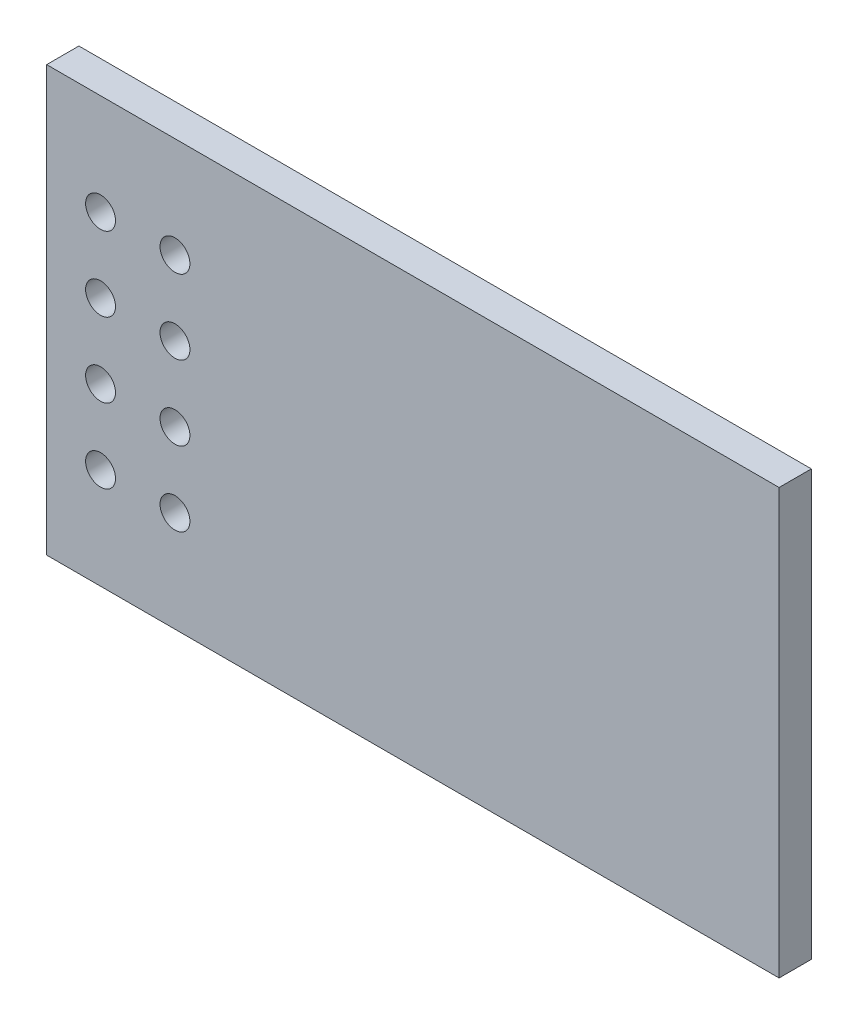
ISO-10303-21;
HEADER;
FILE_DESCRIPTION(('STEP AP214'),'2;1');
FILE_NAME('part.step','',(''),(''),'','','');
FILE_SCHEMA(('AUTOMOTIVE_DESIGN { 1 0 10303 214 1 1 1 1 }'));
ENDSEC;
DATA;
#1=APPLICATION_CONTEXT('core data for automotive mechanical design processes');
#2=APPLICATION_PROTOCOL_DEFINITION('international standard','automotive_design',2000,#1);
#3=PRODUCT_CONTEXT('',#1,'mechanical');
#4=PRODUCT('Part','Part','',(#3));
#5=PRODUCT_RELATED_PRODUCT_CATEGORY('part','',(#4));
#6=PRODUCT_DEFINITION_FORMATION('','',#4);
#7=PRODUCT_DEFINITION_CONTEXT('part definition',#1,'design');
#8=PRODUCT_DEFINITION('design','',#6,#7);
#9=PRODUCT_DEFINITION_SHAPE('','',#8);
#10=(LENGTH_UNIT() NAMED_UNIT(*) SI_UNIT(.MILLI.,.METRE.));
#11=(NAMED_UNIT(*) PLANE_ANGLE_UNIT() SI_UNIT($,.RADIAN.));
#12=(NAMED_UNIT(*) SI_UNIT($,.STERADIAN.) SOLID_ANGLE_UNIT());
#13=UNCERTAINTY_MEASURE_WITH_UNIT(LENGTH_MEASURE(1.E-05),#10,'distance_accuracy_value','');
#14=(GEOMETRIC_REPRESENTATION_CONTEXT(3) GLOBAL_UNCERTAINTY_ASSIGNED_CONTEXT((#13)) GLOBAL_UNIT_ASSIGNED_CONTEXT((#10,
#11,#12)) REPRESENTATION_CONTEXT('',''));
#15=CARTESIAN_POINT('',(0.,0.,0.));
#16=DIRECTION('',(0.,0.,1.));
#17=DIRECTION('',(1.,0.,0.));
#18=AXIS2_PLACEMENT_3D('',#15,#16,#17);
#19=CARTESIAN_POINT('',(4.37910274506,11.06,0.1));
#20=DIRECTION('',(0.,0.,1.));
#21=DIRECTION('',(0.877582561890372,0.479425538604204,0.));
#22=AXIS2_PLACEMENT_3D('',#19,#20,#21);
#23=CYLINDRICAL_SURFACE('',#22,0.51);
#24=CARTESIAN_POINT('',(4.37910274506,11.06,0.));
#25=DIRECTION('',(0.,0.,1.));
#26=DIRECTION('',(-1.,0.,0.));
#27=AXIS2_PLACEMENT_3D('',#24,#25,#26);
#28=CIRCLE('',#27,0.51);
#29=CARTESIAN_POINT('',(3.93153563849591,10.8154929753119,0.));
#30=VERTEX_POINT('',#29);
#31=EDGE_CURVE('E192',#30,#30,#28,.T.);
#32=ORIENTED_EDGE('',*,*,#31,.F.);
#33=DIRECTION('',(0.,0.,1.));
#34=VECTOR('',#33,1.);
#35=CARTESIAN_POINT('',(3.93153563849591,10.8154929753119,0.1));
#36=LINE('',#35,#34);
#37=CARTESIAN_POINT('',(3.93153563849591,10.8154929753119,1.1));
#38=VERTEX_POINT('',#37);
#39=EDGE_CURVE('E11',#30,#38,#36,.T.);
#40=ORIENTED_EDGE('',*,*,#39,.T.);
#41=CARTESIAN_POINT('',(4.37910274506,11.06,1.1));
#42=DIRECTION('',(0.,0.,1.));
#43=DIRECTION('',(-1.,0.,0.));
#44=AXIS2_PLACEMENT_3D('',#41,#42,#43);
#45=CIRCLE('',#44,0.51);
#46=EDGE_CURVE('E132',#38,#38,#45,.T.);
#47=ORIENTED_EDGE('',*,*,#46,.T.);
#48=ORIENTED_EDGE('',*,*,#39,.F.);
#49=EDGE_LOOP('',(#32,#40,#47,#48));
#50=FACE_BOUND('',#49,.T.);
#51=ADVANCED_FACE('F16',(#50),#23,.F.);
#52=CARTESIAN_POINT('',(1.83910274506,11.06,0.1));
#53=DIRECTION('',(0.,0.,1.));
#54=DIRECTION('',(0.877582561890372,0.479425538604204,0.));
#55=AXIS2_PLACEMENT_3D('',#52,#53,#54);
#56=CYLINDRICAL_SURFACE('',#55,0.51);
#57=CARTESIAN_POINT('',(1.83910274506,11.06,0.));
#58=DIRECTION('',(0.,0.,1.));
#59=DIRECTION('',(-1.,0.,0.));
#60=AXIS2_PLACEMENT_3D('',#57,#58,#59);
#61=CIRCLE('',#60,0.51);
#62=CARTESIAN_POINT('',(1.39153563849591,10.8154929753119,0.));
#63=VERTEX_POINT('',#62);
#64=EDGE_CURVE('E224',#63,#63,#61,.T.);
#65=ORIENTED_EDGE('',*,*,#64,.F.);
#66=DIRECTION('',(0.,0.,1.));
#67=VECTOR('',#66,1.);
#68=CARTESIAN_POINT('',(1.39153563849591,10.8154929753119,0.1));
#69=LINE('',#68,#67);
#70=CARTESIAN_POINT('',(1.39153563849591,10.8154929753119,1.1));
#71=VERTEX_POINT('',#70);
#72=EDGE_CURVE('E27',#63,#71,#69,.T.);
#73=ORIENTED_EDGE('',*,*,#72,.T.);
#74=CARTESIAN_POINT('',(1.83910274506,11.06,1.1));
#75=DIRECTION('',(0.,0.,1.));
#76=DIRECTION('',(-1.,0.,0.));
#77=AXIS2_PLACEMENT_3D('',#74,#75,#76);
#78=CIRCLE('',#77,0.51);
#79=EDGE_CURVE('E181',#71,#71,#78,.T.);
#80=ORIENTED_EDGE('',*,*,#79,.T.);
#81=ORIENTED_EDGE('',*,*,#72,.F.);
#82=EDGE_LOOP('',(#65,#73,#80,#81));
#83=FACE_BOUND('',#82,.T.);
#84=ADVANCED_FACE('F358',(#83),#56,.F.);
#85=CARTESIAN_POINT('',(4.37910274506,8.52,0.1));
#86=DIRECTION('',(0.,0.,1.));
#87=DIRECTION('',(0.877582561890372,0.479425538604204,0.));
#88=AXIS2_PLACEMENT_3D('',#85,#86,#87);
#89=CYLINDRICAL_SURFACE('',#88,0.51);
#90=CARTESIAN_POINT('',(4.37910274506,8.52,0.));
#91=DIRECTION('',(0.,0.,1.));
#92=DIRECTION('',(-1.,0.,0.));
#93=AXIS2_PLACEMENT_3D('',#90,#91,#92);
#94=CIRCLE('',#93,0.51);
#95=CARTESIAN_POINT('',(3.93153563849591,8.27549297531186,0.));
#96=VERTEX_POINT('',#95);
#97=EDGE_CURVE('E223',#96,#96,#94,.T.);
#98=ORIENTED_EDGE('',*,*,#97,.F.);
#99=DIRECTION('',(0.,0.,1.));
#100=VECTOR('',#99,1.);
#101=CARTESIAN_POINT('',(3.93153563849591,8.27549297531186,0.1));
#102=LINE('',#101,#100);
#103=CARTESIAN_POINT('',(3.93153563849591,8.27549297531186,1.1));
#104=VERTEX_POINT('',#103);
#105=EDGE_CURVE('E75',#96,#104,#102,.T.);
#106=ORIENTED_EDGE('',*,*,#105,.T.);
#107=CARTESIAN_POINT('',(4.37910274506,8.52,1.1));
#108=DIRECTION('',(0.,0.,1.));
#109=DIRECTION('',(-1.,0.,0.));
#110=AXIS2_PLACEMENT_3D('',#107,#108,#109);
#111=CIRCLE('',#110,0.51);
#112=EDGE_CURVE('E184',#104,#104,#111,.T.);
#113=ORIENTED_EDGE('',*,*,#112,.T.);
#114=ORIENTED_EDGE('',*,*,#105,.F.);
#115=EDGE_LOOP('',(#98,#106,#113,#114));
#116=FACE_BOUND('',#115,.T.);
#117=ADVANCED_FACE('F251',(#116),#89,.F.);
#118=CARTESIAN_POINT('',(1.83910274506,8.52,0.1));
#119=DIRECTION('',(0.,0.,1.));
#120=DIRECTION('',(0.877582561890372,0.479425538604204,0.));
#121=AXIS2_PLACEMENT_3D('',#118,#119,#120);
#122=CYLINDRICAL_SURFACE('',#121,0.51);
#123=CARTESIAN_POINT('',(1.83910274506,8.52,0.));
#124=DIRECTION('',(0.,0.,1.));
#125=DIRECTION('',(-1.,0.,0.));
#126=AXIS2_PLACEMENT_3D('',#123,#124,#125);
#127=CIRCLE('',#126,0.51);
#128=CARTESIAN_POINT('',(1.39153563849591,8.27549297531186,0.));
#129=VERTEX_POINT('',#128);
#130=EDGE_CURVE('E189',#129,#129,#127,.T.);
#131=ORIENTED_EDGE('',*,*,#130,.F.);
#132=DIRECTION('',(0.,0.,1.));
#133=VECTOR('',#132,1.);
#134=CARTESIAN_POINT('',(1.39153563849591,8.27549297531186,0.1));
#135=LINE('',#134,#133);
#136=CARTESIAN_POINT('',(1.39153563849591,8.27549297531186,1.1));
#137=VERTEX_POINT('',#136);
#138=EDGE_CURVE('E87',#129,#137,#135,.T.);
#139=ORIENTED_EDGE('',*,*,#138,.T.);
#140=CARTESIAN_POINT('',(1.83910274506,8.52,1.1));
#141=DIRECTION('',(0.,0.,1.));
#142=DIRECTION('',(-1.,0.,0.));
#143=AXIS2_PLACEMENT_3D('',#140,#141,#142);
#144=CIRCLE('',#143,0.51);
#145=EDGE_CURVE('E214',#137,#137,#144,.T.);
#146=ORIENTED_EDGE('',*,*,#145,.T.);
#147=ORIENTED_EDGE('',*,*,#138,.F.);
#148=EDGE_LOOP('',(#131,#139,#146,#147));
#149=FACE_BOUND('',#148,.T.);
#150=ADVANCED_FACE('F368',(#149),#122,.F.);
#151=CARTESIAN_POINT('',(4.37910274506,5.98,0.1));
#152=DIRECTION('',(0.,0.,1.));
#153=DIRECTION('',(0.877582561890372,0.479425538604204,0.));
#154=AXIS2_PLACEMENT_3D('',#151,#152,#153);
#155=CYLINDRICAL_SURFACE('',#154,0.51);
#156=CARTESIAN_POINT('',(4.37910274506,5.98,0.));
#157=DIRECTION('',(0.,0.,1.));
#158=DIRECTION('',(-1.,0.,0.));
#159=AXIS2_PLACEMENT_3D('',#156,#157,#158);
#160=CIRCLE('',#159,0.51);
#161=CARTESIAN_POINT('',(3.93153563849591,5.73549297531186,0.));
#162=VERTEX_POINT('',#161);
#163=EDGE_CURVE('E145',#162,#162,#160,.T.);
#164=ORIENTED_EDGE('',*,*,#163,.F.);
#165=DIRECTION('',(0.,0.,1.));
#166=VECTOR('',#165,1.);
#167=CARTESIAN_POINT('',(3.93153563849591,5.73549297531186,0.1));
#168=LINE('',#167,#166);
#169=CARTESIAN_POINT('',(3.93153563849591,5.73549297531186,1.1));
#170=VERTEX_POINT('',#169);
#171=EDGE_CURVE('E193',#162,#170,#168,.T.);
#172=ORIENTED_EDGE('',*,*,#171,.T.);
#173=CARTESIAN_POINT('',(4.37910274506,5.98,1.1));
#174=DIRECTION('',(0.,0.,1.));
#175=DIRECTION('',(-1.,0.,0.));
#176=AXIS2_PLACEMENT_3D('',#173,#174,#175);
#177=CIRCLE('',#176,0.51);
#178=EDGE_CURVE('E180',#170,#170,#177,.T.);
#179=ORIENTED_EDGE('',*,*,#178,.T.);
#180=ORIENTED_EDGE('',*,*,#171,.F.);
#181=EDGE_LOOP('',(#164,#172,#179,#180));
#182=FACE_BOUND('',#181,.T.);
#183=ADVANCED_FACE('F370',(#182),#155,.F.);
#184=CARTESIAN_POINT('',(1.83910274506,5.98,0.1));
#185=DIRECTION('',(0.,0.,1.));
#186=DIRECTION('',(0.877582561890372,0.479425538604204,0.));
#187=AXIS2_PLACEMENT_3D('',#184,#185,#186);
#188=CYLINDRICAL_SURFACE('',#187,0.51);
#189=CARTESIAN_POINT('',(1.83910274506,5.98,0.));
#190=DIRECTION('',(0.,0.,1.));
#191=DIRECTION('',(-1.,0.,0.));
#192=AXIS2_PLACEMENT_3D('',#189,#190,#191);
#193=CIRCLE('',#192,0.51);
#194=CARTESIAN_POINT('',(1.39153563849591,5.73549297531186,0.));
#195=VERTEX_POINT('',#194);
#196=EDGE_CURVE('E138',#195,#195,#193,.T.);
#197=ORIENTED_EDGE('',*,*,#196,.F.);
#198=DIRECTION('',(0.,0.,1.));
#199=VECTOR('',#198,1.);
#200=CARTESIAN_POINT('',(1.39153563849591,5.73549297531186,0.1));
#201=LINE('',#200,#199);
#202=CARTESIAN_POINT('',(1.39153563849591,5.73549297531186,1.1));
#203=VERTEX_POINT('',#202);
#204=EDGE_CURVE('E20',#195,#203,#201,.T.);
#205=ORIENTED_EDGE('',*,*,#204,.T.);
#206=CARTESIAN_POINT('',(1.83910274506,5.98,1.1));
#207=DIRECTION('',(0.,0.,1.));
#208=DIRECTION('',(-1.,0.,0.));
#209=AXIS2_PLACEMENT_3D('',#206,#207,#208);
#210=CIRCLE('',#209,0.51);
#211=EDGE_CURVE('E177',#203,#203,#210,.T.);
#212=ORIENTED_EDGE('',*,*,#211,.T.);
#213=ORIENTED_EDGE('',*,*,#204,.F.);
#214=EDGE_LOOP('',(#197,#205,#212,#213));
#215=FACE_BOUND('',#214,.T.);
#216=ADVANCED_FACE('F375',(#215),#188,.F.);
#217=CARTESIAN_POINT('',(4.37910274506,3.44,0.1));
#218=DIRECTION('',(0.,0.,1.));
#219=DIRECTION('',(0.877582561890372,0.479425538604204,0.));
#220=AXIS2_PLACEMENT_3D('',#217,#218,#219);
#221=CYLINDRICAL_SURFACE('',#220,0.51);
#222=CARTESIAN_POINT('',(4.37910274506,3.44,0.));
#223=DIRECTION('',(0.,0.,1.));
#224=DIRECTION('',(-1.,0.,0.));
#225=AXIS2_PLACEMENT_3D('',#222,#223,#224);
#226=CIRCLE('',#225,0.51);
#227=CARTESIAN_POINT('',(3.93153563849591,3.19549297531186,0.));
#228=VERTEX_POINT('',#227);
#229=EDGE_CURVE('E128',#228,#228,#226,.T.);
#230=ORIENTED_EDGE('',*,*,#229,.F.);
#231=DIRECTION('',(0.,0.,1.));
#232=VECTOR('',#231,1.);
#233=CARTESIAN_POINT('',(3.93153563849591,3.19549297531186,0.1));
#234=LINE('',#233,#232);
#235=CARTESIAN_POINT('',(3.93153563849591,3.19549297531186,1.1));
#236=VERTEX_POINT('',#235);
#237=EDGE_CURVE('E125',#228,#236,#234,.T.);
#238=ORIENTED_EDGE('',*,*,#237,.T.);
#239=CARTESIAN_POINT('',(4.37910274506,3.44,1.1));
#240=DIRECTION('',(0.,0.,1.));
#241=DIRECTION('',(-1.,0.,0.));
#242=AXIS2_PLACEMENT_3D('',#239,#240,#241);
#243=CIRCLE('',#242,0.51);
#244=EDGE_CURVE('E130',#236,#236,#243,.T.);
#245=ORIENTED_EDGE('',*,*,#244,.T.);
#246=ORIENTED_EDGE('',*,*,#237,.F.);
#247=EDGE_LOOP('',(#230,#238,#245,#246));
#248=FACE_BOUND('',#247,.T.);
#249=ADVANCED_FACE('F127',(#248),#221,.F.);
#250=CARTESIAN_POINT('',(0.,0.,1.1));
#251=DIRECTION('',(0.,0.,1.));
#252=DIRECTION('',(1.,0.,0.));
#253=AXIS2_PLACEMENT_3D('',#250,#251,#252);
#254=PLANE('',#253);
#255=ORIENTED_EDGE('',*,*,#46,.F.);
#256=EDGE_LOOP('',(#255));
#257=FACE_BOUND('',#256,.T.);
#258=ORIENTED_EDGE('',*,*,#79,.F.);
#259=EDGE_LOOP('',(#258));
#260=FACE_BOUND('',#259,.T.);
#261=ORIENTED_EDGE('',*,*,#112,.F.);
#262=EDGE_LOOP('',(#261));
#263=FACE_BOUND('',#262,.T.);
#264=ORIENTED_EDGE('',*,*,#145,.F.);
#265=EDGE_LOOP('',(#264));
#266=FACE_BOUND('',#265,.T.);
#267=ORIENTED_EDGE('',*,*,#178,.F.);
#268=EDGE_LOOP('',(#267));
#269=FACE_BOUND('',#268,.T.);
#270=ORIENTED_EDGE('',*,*,#211,.F.);
#271=EDGE_LOOP('',(#270));
#272=FACE_BOUND('',#271,.T.);
#273=CARTESIAN_POINT('',(1.83910274506,3.44,1.1));
#274=DIRECTION('',(0.,0.,1.));
#275=DIRECTION('',(-1.,0.,0.));
#276=AXIS2_PLACEMENT_3D('',#273,#274,#275);
#277=CIRCLE('',#276,0.51);
#278=CARTESIAN_POINT('',(1.39153563849591,3.19549297531186,1.1));
#279=VERTEX_POINT('',#278);
#280=EDGE_CURVE('E160',#279,#279,#277,.T.);
#281=ORIENTED_EDGE('',*,*,#280,.F.);
#282=EDGE_LOOP('',(#281));
#283=FACE_BOUND('',#282,.T.);
#284=ORIENTED_EDGE('',*,*,#244,.F.);
#285=EDGE_LOOP('',(#284));
#286=FACE_BOUND('',#285,.T.);
#287=DIRECTION('',(1.,0.,0.));
#288=VECTOR('',#287,1.);
#289=CARTESIAN_POINT('',(12.5,0.,1.1));
#290=LINE('',#289,#288);
#291=CARTESIAN_POINT('',(0.,0.,1.1));
#292=VERTEX_POINT('',#291);
#293=CARTESIAN_POINT('',(25.,0.,1.1));
#294=VERTEX_POINT('',#293);
#295=EDGE_CURVE('E165',#292,#294,#290,.T.);
#296=ORIENTED_EDGE('',*,*,#295,.T.);
#297=DIRECTION('',(0.,1.,0.));
#298=VECTOR('',#297,1.);
#299=CARTESIAN_POINT('',(25.,7.25,1.1));
#300=LINE('',#299,#298);
#301=CARTESIAN_POINT('',(25.,14.5,1.1));
#302=VERTEX_POINT('',#301);
#303=EDGE_CURVE('E172',#294,#302,#300,.T.);
#304=ORIENTED_EDGE('',*,*,#303,.T.);
#305=DIRECTION('',(-1.,0.,0.));
#306=VECTOR('',#305,1.);
#307=CARTESIAN_POINT('',(12.5,14.5,1.1));
#308=LINE('',#307,#306);
#309=CARTESIAN_POINT('',(0.,14.5,1.1));
#310=VERTEX_POINT('',#309);
#311=EDGE_CURVE('E201',#302,#310,#308,.T.);
#312=ORIENTED_EDGE('',*,*,#311,.T.);
#313=DIRECTION('',(0.,-1.,0.));
#314=VECTOR('',#313,1.);
#315=CARTESIAN_POINT('',(0.,7.25,1.1));
#316=LINE('',#315,#314);
#317=EDGE_CURVE('E139',#310,#292,#316,.T.);
#318=ORIENTED_EDGE('',*,*,#317,.T.);
#319=EDGE_LOOP('',(#296,#304,#312,#318));
#320=FACE_BOUND('',#319,.T.);
#321=ADVANCED_FACE('F254',(#257,#260,#263,#266,#269,#272,#283,#286,#320),#254,.T.);
#322=CARTESIAN_POINT('',(0.,0.,0.));
#323=DIRECTION('',(0.,0.,1.));
#324=DIRECTION('',(1.,0.,0.));
#325=AXIS2_PLACEMENT_3D('',#322,#323,#324);
#326=PLANE('',#325);
#327=ORIENTED_EDGE('',*,*,#31,.T.);
#328=EDGE_LOOP('',(#327));
#329=FACE_BOUND('',#328,.T.);
#330=ORIENTED_EDGE('',*,*,#64,.T.);
#331=EDGE_LOOP('',(#330));
#332=FACE_BOUND('',#331,.T.);
#333=ORIENTED_EDGE('',*,*,#97,.T.);
#334=EDGE_LOOP('',(#333));
#335=FACE_BOUND('',#334,.T.);
#336=ORIENTED_EDGE('',*,*,#130,.T.);
#337=EDGE_LOOP('',(#336));
#338=FACE_BOUND('',#337,.T.);
#339=ORIENTED_EDGE('',*,*,#163,.T.);
#340=EDGE_LOOP('',(#339));
#341=FACE_BOUND('',#340,.T.);
#342=ORIENTED_EDGE('',*,*,#196,.T.);
#343=EDGE_LOOP('',(#342));
#344=FACE_BOUND('',#343,.T.);
#345=CARTESIAN_POINT('',(1.83910274506,3.44,0.));
#346=DIRECTION('',(0.,0.,1.));
#347=DIRECTION('',(-1.,0.,0.));
#348=AXIS2_PLACEMENT_3D('',#345,#346,#347);
#349=CIRCLE('',#348,0.51);
#350=CARTESIAN_POINT('',(1.39153563849591,3.19549297531186,0.));
#351=VERTEX_POINT('',#350);
#352=EDGE_CURVE('E153',#351,#351,#349,.T.);
#353=ORIENTED_EDGE('',*,*,#352,.T.);
#354=EDGE_LOOP('',(#353));
#355=FACE_BOUND('',#354,.T.);
#356=ORIENTED_EDGE('',*,*,#229,.T.);
#357=EDGE_LOOP('',(#356));
#358=FACE_BOUND('',#357,.T.);
#359=DIRECTION('',(0.,-1.,0.));
#360=VECTOR('',#359,1.);
#361=CARTESIAN_POINT('',(0.,7.25,0.));
#362=LINE('',#361,#360);
#363=CARTESIAN_POINT('',(0.,14.5,0.));
#364=VERTEX_POINT('',#363);
#365=CARTESIAN_POINT('',(0.,0.,0.));
#366=VERTEX_POINT('',#365);
#367=EDGE_CURVE('E148',#364,#366,#362,.T.);
#368=ORIENTED_EDGE('',*,*,#367,.F.);
#369=DIRECTION('',(-1.,0.,0.));
#370=VECTOR('',#369,1.);
#371=CARTESIAN_POINT('',(12.5,14.5,0.));
#372=LINE('',#371,#370);
#373=CARTESIAN_POINT('',(25.,14.5,0.));
#374=VERTEX_POINT('',#373);
#375=EDGE_CURVE('E167',#374,#364,#372,.T.);
#376=ORIENTED_EDGE('',*,*,#375,.F.);
#377=DIRECTION('',(0.,1.,0.));
#378=VECTOR('',#377,1.);
#379=CARTESIAN_POINT('',(25.,7.25,0.));
#380=LINE('',#379,#378);
#381=CARTESIAN_POINT('',(25.,0.,0.));
#382=VERTEX_POINT('',#381);
#383=EDGE_CURVE('E176',#382,#374,#380,.T.);
#384=ORIENTED_EDGE('',*,*,#383,.F.);
#385=DIRECTION('',(1.,0.,0.));
#386=VECTOR('',#385,1.);
#387=CARTESIAN_POINT('',(12.5,0.,0.));
#388=LINE('',#387,#386);
#389=EDGE_CURVE('E166',#366,#382,#388,.T.);
#390=ORIENTED_EDGE('',*,*,#389,.F.);
#391=EDGE_LOOP('',(#368,#376,#384,#390));
#392=FACE_BOUND('',#391,.T.);
#393=ADVANCED_FACE('F135',(#329,#332,#335,#338,#341,#344,#355,#358,#392),#326,.F.);
#394=CARTESIAN_POINT('',(0.,14.5,0.));
#395=DIRECTION('',(-1.,0.,0.));
#396=DIRECTION('',(0.,0.,1.));
#397=AXIS2_PLACEMENT_3D('',#394,#395,#396);
#398=PLANE('',#397);
#399=DIRECTION('',(0.,0.,1.));
#400=VECTOR('',#399,1.);
#401=CARTESIAN_POINT('',(0.,14.5,0.55));
#402=LINE('',#401,#400);
#403=EDGE_CURVE('E171',#364,#310,#402,.T.);
#404=ORIENTED_EDGE('',*,*,#403,.F.);
#405=ORIENTED_EDGE('',*,*,#367,.T.);
#406=DIRECTION('',(0.,0.,1.));
#407=VECTOR('',#406,1.);
#408=CARTESIAN_POINT('',(0.,0.,0.55));
#409=LINE('',#408,#407);
#410=EDGE_CURVE('E199',#366,#292,#409,.T.);
#411=ORIENTED_EDGE('',*,*,#410,.T.);
#412=ORIENTED_EDGE('',*,*,#317,.F.);
#413=EDGE_LOOP('',(#404,#405,#411,#412));
#414=FACE_BOUND('',#413,.T.);
#415=ADVANCED_FACE('F301',(#414),#398,.T.);
#416=CARTESIAN_POINT('',(25.,14.5,0.));
#417=DIRECTION('',(0.,1.,0.));
#418=DIRECTION('',(1.,0.,0.));
#419=AXIS2_PLACEMENT_3D('',#416,#417,#418);
#420=PLANE('',#419);
#421=DIRECTION('',(0.,0.,1.));
#422=VECTOR('',#421,1.);
#423=CARTESIAN_POINT('',(25.,14.5,0.55));
#424=LINE('',#423,#422);
#425=EDGE_CURVE('E210',#374,#302,#424,.T.);
#426=ORIENTED_EDGE('',*,*,#425,.F.);
#427=ORIENTED_EDGE('',*,*,#375,.T.);
#428=ORIENTED_EDGE('',*,*,#403,.T.);
#429=ORIENTED_EDGE('',*,*,#311,.F.);
#430=EDGE_LOOP('',(#426,#427,#428,#429));
#431=FACE_BOUND('',#430,.T.);
#432=ADVANCED_FACE('F303',(#431),#420,.T.);
#433=CARTESIAN_POINT('',(25.,0.,0.));
#434=DIRECTION('',(1.,0.,0.));
#435=DIRECTION('',(0.,1.,0.));
#436=AXIS2_PLACEMENT_3D('',#433,#434,#435);
#437=PLANE('',#436);
#438=DIRECTION('',(0.,0.,1.));
#439=VECTOR('',#438,1.);
#440=CARTESIAN_POINT('',(25.,0.,0.55));
#441=LINE('',#440,#439);
#442=EDGE_CURVE('E161',#382,#294,#441,.T.);
#443=ORIENTED_EDGE('',*,*,#442,.F.);
#444=ORIENTED_EDGE('',*,*,#383,.T.);
#445=ORIENTED_EDGE('',*,*,#425,.T.);
#446=ORIENTED_EDGE('',*,*,#303,.F.);
#447=EDGE_LOOP('',(#443,#444,#445,#446));
#448=FACE_BOUND('',#447,.T.);
#449=ADVANCED_FACE('F279',(#448),#437,.T.);
#450=CARTESIAN_POINT('',(0.,0.,0.));
#451=DIRECTION('',(0.,-1.,0.));
#452=DIRECTION('',(0.,0.,-1.));
#453=AXIS2_PLACEMENT_3D('',#450,#451,#452);
#454=PLANE('',#453);
#455=ORIENTED_EDGE('',*,*,#410,.F.);
#456=ORIENTED_EDGE('',*,*,#389,.T.);
#457=ORIENTED_EDGE('',*,*,#442,.T.);
#458=ORIENTED_EDGE('',*,*,#295,.F.);
#459=EDGE_LOOP('',(#455,#456,#457,#458));
#460=FACE_BOUND('',#459,.T.);
#461=ADVANCED_FACE('F18',(#460),#454,.T.);
#462=CARTESIAN_POINT('',(1.83910274506,3.44,0.1));
#463=DIRECTION('',(0.,0.,1.));
#464=DIRECTION('',(0.877582561890372,0.479425538604204,0.));
#465=AXIS2_PLACEMENT_3D('',#462,#463,#464);
#466=CYLINDRICAL_SURFACE('',#465,0.51);
#467=ORIENTED_EDGE('',*,*,#352,.F.);
#468=DIRECTION('',(0.,0.,1.));
#469=VECTOR('',#468,1.);
#470=CARTESIAN_POINT('',(1.39153563849591,3.19549297531186,0.1));
#471=LINE('',#470,#469);
#472=EDGE_CURVE('E156',#351,#279,#471,.T.);
#473=ORIENTED_EDGE('',*,*,#472,.T.);
#474=ORIENTED_EDGE('',*,*,#280,.T.);
#475=ORIENTED_EDGE('',*,*,#472,.F.);
#476=EDGE_LOOP('',(#467,#473,#474,#475));
#477=FACE_BOUND('',#476,.T.);
#478=ADVANCED_FACE('F366',(#477),#466,.F.);
#479=CLOSED_SHELL('',(#51,#84,#117,#150,#183,#216,#249,#321,#393,#415,#432,#449,#461,#478));
#480=MANIFOLD_SOLID_BREP('B1',#479);
#481=ADVANCED_BREP_SHAPE_REPRESENTATION('',(#18,#480),#14);
#482=SHAPE_DEFINITION_REPRESENTATION(#9,#481);
ENDSEC;
END-ISO-10303-21;
